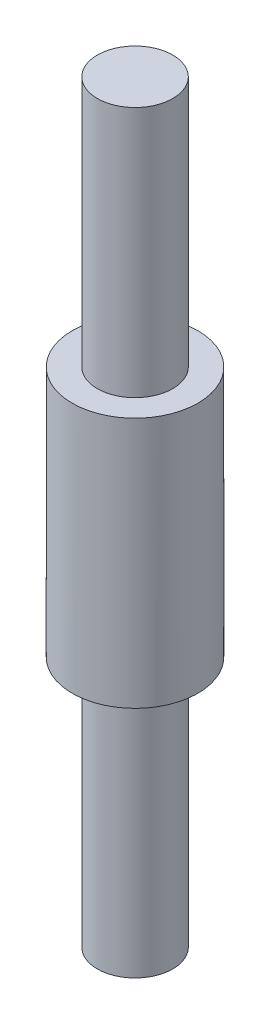
ISO-10303-21;
HEADER;
FILE_DESCRIPTION(('STEP AP214'),'2;1');
FILE_NAME('part.step','',(''),(''),'','','');
FILE_SCHEMA(('AUTOMOTIVE_DESIGN { 1 0 10303 214 1 1 1 1 }'));
ENDSEC;
DATA;
#1=APPLICATION_CONTEXT('core data for automotive mechanical design processes');
#2=APPLICATION_PROTOCOL_DEFINITION('international standard','automotive_design',2000,#1);
#3=PRODUCT_CONTEXT('',#1,'mechanical');
#4=PRODUCT('Part','Part','',(#3));
#5=PRODUCT_RELATED_PRODUCT_CATEGORY('part','',(#4));
#6=PRODUCT_DEFINITION_FORMATION('','',#4);
#7=PRODUCT_DEFINITION_CONTEXT('part definition',#1,'design');
#8=PRODUCT_DEFINITION('design','',#6,#7);
#9=PRODUCT_DEFINITION_SHAPE('','',#8);
#10=(LENGTH_UNIT() NAMED_UNIT(*) SI_UNIT(.MILLI.,.METRE.));
#11=(NAMED_UNIT(*) PLANE_ANGLE_UNIT() SI_UNIT($,.RADIAN.));
#12=(NAMED_UNIT(*) SI_UNIT($,.STERADIAN.) SOLID_ANGLE_UNIT());
#13=UNCERTAINTY_MEASURE_WITH_UNIT(LENGTH_MEASURE(1.E-05),#10,'distance_accuracy_value','');
#14=(GEOMETRIC_REPRESENTATION_CONTEXT(3) GLOBAL_UNCERTAINTY_ASSIGNED_CONTEXT((#13)) GLOBAL_UNIT_ASSIGNED_CONTEXT((#10,
#11,#12)) REPRESENTATION_CONTEXT('',''));
#15=CARTESIAN_POINT('',(0.,0.,0.));
#16=DIRECTION('',(0.,0.,1.));
#17=DIRECTION('',(1.,0.,0.));
#18=AXIS2_PLACEMENT_3D('',#15,#16,#17);
#19=CARTESIAN_POINT('',(0.,15.,0.));
#20=DIRECTION('',(0.,-1.,0.));
#21=DIRECTION('',(0.,0.,-1.));
#22=AXIS2_PLACEMENT_3D('',#19,#20,#21);
#23=CYLINDRICAL_SURFACE('',#22,2.5);
#24=CARTESIAN_POINT('',(0.,5.,0.));
#25=DIRECTION('',(0.,1.,0.));
#26=DIRECTION('',(0.,0.,1.));
#27=AXIS2_PLACEMENT_3D('',#24,#25,#26);
#28=CIRCLE('',#27,2.5);
#29=CARTESIAN_POINT('',(0.,5.,2.5));
#30=VERTEX_POINT('',#29);
#31=EDGE_CURVE('E10',#30,#30,#28,.T.);
#32=ORIENTED_EDGE('',*,*,#31,.F.);
#33=EDGE_LOOP('',(#32));
#34=FACE_BOUND('',#33,.T.);
#35=CARTESIAN_POINT('',(0.,-5.,0.));
#36=DIRECTION('',(0.,-1.,0.));
#37=DIRECTION('',(0.,0.,-1.));
#38=AXIS2_PLACEMENT_3D('',#35,#36,#37);
#39=CIRCLE('',#38,2.5);
#40=CARTESIAN_POINT('',(0.,-5.,-2.5));
#41=VERTEX_POINT('',#40);
#42=EDGE_CURVE('E33',#41,#41,#39,.T.);
#43=ORIENTED_EDGE('',*,*,#42,.F.);
#44=EDGE_LOOP('',(#43));
#45=FACE_BOUND('',#44,.T.);
#46=ADVANCED_FACE('F30',(#34,#45),#23,.T.);
#47=CARTESIAN_POINT('',(0.,5.,0.));
#48=DIRECTION('',(0.,1.,0.));
#49=DIRECTION('',(0.,0.,1.));
#50=AXIS2_PLACEMENT_3D('',#47,#48,#49);
#51=PLANE('',#50);
#52=CARTESIAN_POINT('',(0.,5.,0.));
#53=DIRECTION('',(0.,1.,0.));
#54=DIRECTION('',(0.,0.,1.));
#55=AXIS2_PLACEMENT_3D('',#52,#53,#54);
#56=CIRCLE('',#55,1.5);
#57=CARTESIAN_POINT('',(0.,5.,1.5));
#58=VERTEX_POINT('',#57);
#59=EDGE_CURVE('E37',#58,#58,#56,.T.);
#60=ORIENTED_EDGE('',*,*,#59,.F.);
#61=EDGE_LOOP('',(#60));
#62=FACE_BOUND('',#61,.T.);
#63=ORIENTED_EDGE('',*,*,#31,.T.);
#64=EDGE_LOOP('',(#63));
#65=FACE_BOUND('',#64,.T.);
#66=ADVANCED_FACE('F59',(#62,#65),#51,.T.);
#67=CARTESIAN_POINT('',(0.,5.,0.));
#68=DIRECTION('',(0.,1.,0.));
#69=DIRECTION('',(0.,0.,1.));
#70=AXIS2_PLACEMENT_3D('',#67,#68,#69);
#71=CYLINDRICAL_SURFACE('',#70,1.5);
#72=ORIENTED_EDGE('',*,*,#59,.T.);
#73=EDGE_LOOP('',(#72));
#74=FACE_BOUND('',#73,.T.);
#75=CARTESIAN_POINT('',(0.,15.,0.));
#76=DIRECTION('',(0.,1.,0.));
#77=DIRECTION('',(0.,0.,1.));
#78=AXIS2_PLACEMENT_3D('',#75,#76,#77);
#79=CIRCLE('',#78,1.5);
#80=CARTESIAN_POINT('',(0.,15.,1.5));
#81=VERTEX_POINT('',#80);
#82=EDGE_CURVE('E41',#81,#81,#79,.T.);
#83=ORIENTED_EDGE('',*,*,#82,.F.);
#84=EDGE_LOOP('',(#83));
#85=FACE_BOUND('',#84,.T.);
#86=ADVANCED_FACE('F64',(#74,#85),#71,.T.);
#87=CARTESIAN_POINT('',(0.,15.,0.));
#88=DIRECTION('',(0.,1.,0.));
#89=DIRECTION('',(0.,0.,1.));
#90=AXIS2_PLACEMENT_3D('',#87,#88,#89);
#91=PLANE('',#90);
#92=ORIENTED_EDGE('',*,*,#82,.T.);
#93=EDGE_LOOP('',(#92));
#94=FACE_BOUND('',#93,.T.);
#95=ADVANCED_FACE('F70',(#94),#91,.T.);
#96=CARTESIAN_POINT('',(0.,-5.,0.));
#97=DIRECTION('',(0.,-1.,0.));
#98=DIRECTION('',(0.,0.,1.));
#99=AXIS2_PLACEMENT_3D('',#96,#97,#98);
#100=PLANE('',#99);
#101=CARTESIAN_POINT('',(0.,-5.,0.));
#102=DIRECTION('',(0.,1.,0.));
#103=DIRECTION('',(0.,0.,1.));
#104=AXIS2_PLACEMENT_3D('',#101,#102,#103);
#105=CIRCLE('',#104,1.5);
#106=CARTESIAN_POINT('',(0.,-5.,1.5));
#107=VERTEX_POINT('',#106);
#108=EDGE_CURVE('E49',#107,#107,#105,.T.);
#109=ORIENTED_EDGE('',*,*,#108,.T.);
#110=EDGE_LOOP('',(#109));
#111=FACE_BOUND('',#110,.T.);
#112=ORIENTED_EDGE('',*,*,#42,.T.);
#113=EDGE_LOOP('',(#112));
#114=FACE_BOUND('',#113,.T.);
#115=ADVANCED_FACE('F56',(#111,#114),#100,.T.);
#116=CARTESIAN_POINT('',(0.,-5.,0.));
#117=DIRECTION('',(0.,-1.,0.));
#118=DIRECTION('',(0.,0.,-1.));
#119=AXIS2_PLACEMENT_3D('',#116,#117,#118);
#120=CYLINDRICAL_SURFACE('',#119,1.5);
#121=ORIENTED_EDGE('',*,*,#108,.F.);
#122=EDGE_LOOP('',(#121));
#123=FACE_BOUND('',#122,.T.);
#124=CARTESIAN_POINT('',(0.,-15.,0.));
#125=DIRECTION('',(0.,1.,0.));
#126=DIRECTION('',(0.,0.,1.));
#127=AXIS2_PLACEMENT_3D('',#124,#125,#126);
#128=CIRCLE('',#127,1.5);
#129=CARTESIAN_POINT('',(0.,-15.,1.5));
#130=VERTEX_POINT('',#129);
#131=EDGE_CURVE('E46',#130,#130,#128,.T.);
#132=ORIENTED_EDGE('',*,*,#131,.T.);
#133=EDGE_LOOP('',(#132));
#134=FACE_BOUND('',#133,.T.);
#135=ADVANCED_FACE('F80',(#123,#134),#120,.T.);
#136=CARTESIAN_POINT('',(0.,-15.,0.));
#137=DIRECTION('',(0.,1.,0.));
#138=DIRECTION('',(0.,0.,1.));
#139=AXIS2_PLACEMENT_3D('',#136,#137,#138);
#140=PLANE('',#139);
#141=ORIENTED_EDGE('',*,*,#131,.F.);
#142=EDGE_LOOP('',(#141));
#143=FACE_BOUND('',#142,.T.);
#144=ADVANCED_FACE('F78',(#143),#140,.F.);
#145=CLOSED_SHELL('',(#46,#66,#86,#95,#115,#135,#144));
#146=MANIFOLD_SOLID_BREP('B2',#145);
#147=ADVANCED_BREP_SHAPE_REPRESENTATION('',(#18,#146),#14);
#148=SHAPE_DEFINITION_REPRESENTATION(#9,#147);
ENDSEC;
END-ISO-10303-21;
